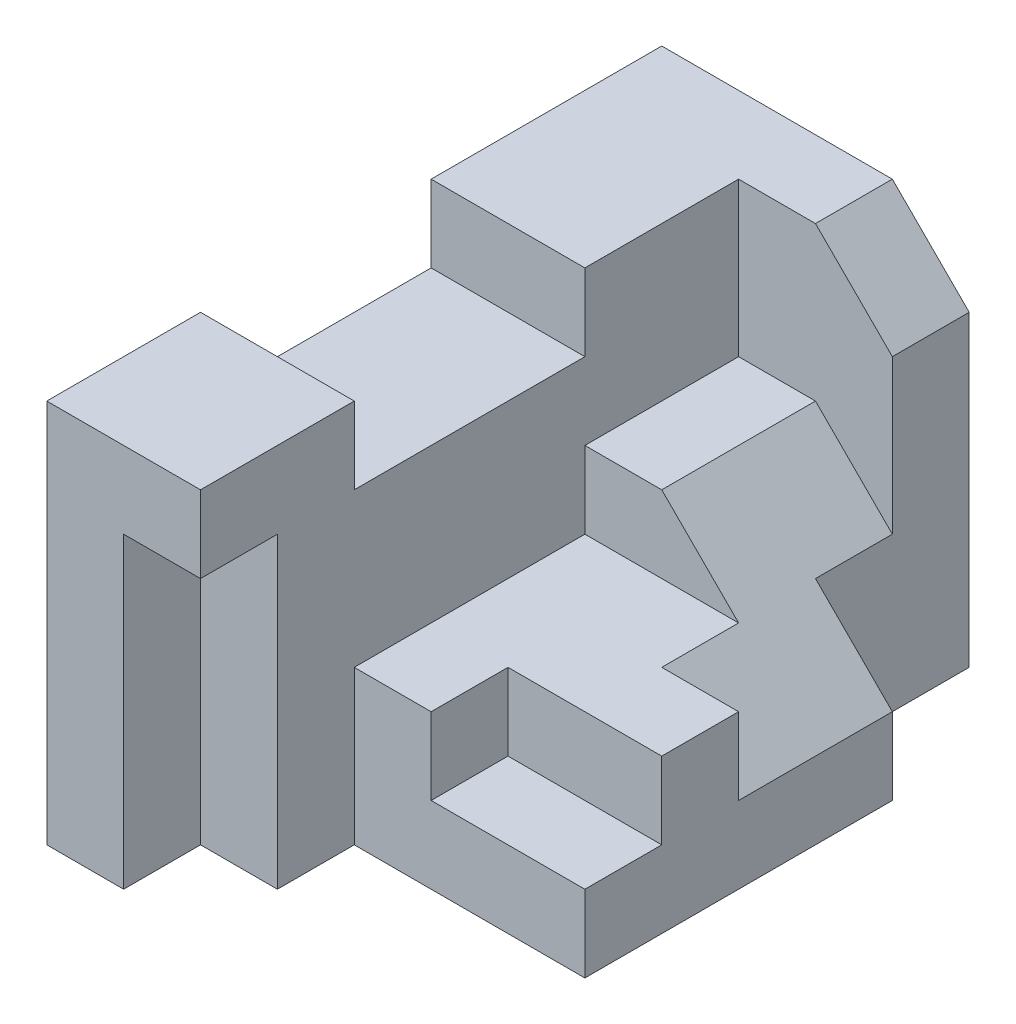
ISO-10303-21;
HEADER;
FILE_DESCRIPTION(('STEP AP214'),'2;1');
FILE_NAME('part.step','',(''),(''),'','','');
FILE_SCHEMA(('AUTOMOTIVE_DESIGN { 1 0 10303 214 1 1 1 1 }'));
ENDSEC;
DATA;
#1=APPLICATION_CONTEXT('core data for automotive mechanical design processes');
#2=APPLICATION_PROTOCOL_DEFINITION('international standard','automotive_design',2000,#1);
#3=PRODUCT_CONTEXT('',#1,'mechanical');
#4=PRODUCT('Part','Part','',(#3));
#5=PRODUCT_RELATED_PRODUCT_CATEGORY('part','',(#4));
#6=PRODUCT_DEFINITION_FORMATION('','',#4);
#7=PRODUCT_DEFINITION_CONTEXT('part definition',#1,'design');
#8=PRODUCT_DEFINITION('design','',#6,#7);
#9=PRODUCT_DEFINITION_SHAPE('','',#8);
#10=(LENGTH_UNIT() NAMED_UNIT(*) SI_UNIT(.MILLI.,.METRE.));
#11=(NAMED_UNIT(*) PLANE_ANGLE_UNIT() SI_UNIT($,.RADIAN.));
#12=(NAMED_UNIT(*) SI_UNIT($,.STERADIAN.) SOLID_ANGLE_UNIT());
#13=UNCERTAINTY_MEASURE_WITH_UNIT(LENGTH_MEASURE(1.E-05),#10,'distance_accuracy_value','');
#14=(GEOMETRIC_REPRESENTATION_CONTEXT(3) GLOBAL_UNCERTAINTY_ASSIGNED_CONTEXT((#13)) GLOBAL_UNIT_ASSIGNED_CONTEXT((#10,
#11,#12)) REPRESENTATION_CONTEXT('',''));
#15=CARTESIAN_POINT('',(0.,0.,0.));
#16=DIRECTION('',(0.,0.,1.));
#17=DIRECTION('',(1.,0.,0.));
#18=AXIS2_PLACEMENT_3D('',#15,#16,#17);
#19=CARTESIAN_POINT('',(2.5,2.5,8.));
#20=DIRECTION('',(0.,-1.,0.));
#21=DIRECTION('',(1.,0.,0.));
#22=AXIS2_PLACEMENT_3D('',#19,#20,#21);
#23=PLANE('',#22);
#24=DIRECTION('',(-1.,0.,0.));
#25=VECTOR('',#24,1.);
#26=CARTESIAN_POINT('',(2.5,2.5,8.));
#27=LINE('',#26,#25);
#28=CARTESIAN_POINT('',(-0.5,2.5,8.));
#29=VERTEX_POINT('',#28);
#30=CARTESIAN_POINT('',(-2.5,2.5,8.));
#31=VERTEX_POINT('',#30);
#32=EDGE_CURVE('E317',#29,#31,#27,.T.);
#33=ORIENTED_EDGE('',*,*,#32,.F.);
#34=DIRECTION('',(0.,0.,1.));
#35=VECTOR('',#34,1.);
#36=CARTESIAN_POINT('',(-0.5,2.5,8.));
#37=LINE('',#36,#35);
#38=CARTESIAN_POINT('',(-0.5,2.5,6.));
#39=VERTEX_POINT('',#38);
#40=EDGE_CURVE('E398',#39,#29,#37,.T.);
#41=ORIENTED_EDGE('',*,*,#40,.F.);
#42=DIRECTION('',(1.,0.,0.));
#43=VECTOR('',#42,1.);
#44=CARTESIAN_POINT('',(-0.5,2.5,6.));
#45=LINE('',#44,#43);
#46=CARTESIAN_POINT('',(-2.5,2.5,6.));
#47=VERTEX_POINT('',#46);
#48=EDGE_CURVE('E277',#47,#39,#45,.T.);
#49=ORIENTED_EDGE('',*,*,#48,.F.);
#50=DIRECTION('',(0.,0.,-1.));
#51=VECTOR('',#50,1.);
#52=CARTESIAN_POINT('',(-2.5,2.5,8.));
#53=LINE('',#52,#51);
#54=EDGE_CURVE('E326',#31,#47,#53,.T.);
#55=ORIENTED_EDGE('',*,*,#54,.F.);
#56=EDGE_LOOP('',(#33,#41,#49,#55));
#57=FACE_BOUND('',#56,.T.);
#58=ADVANCED_FACE('F33',(#57),#23,.F.);
#59=CARTESIAN_POINT('',(-2.5,-2.5,8.));
#60=DIRECTION('',(1.,0.,0.));
#61=DIRECTION('',(0.,0.,-1.));
#62=AXIS2_PLACEMENT_3D('',#59,#60,#61);
#63=PLANE('',#62);
#64=DIRECTION('',(0.,0.,1.));
#65=VECTOR('',#64,1.);
#66=CARTESIAN_POINT('',(-2.5,1.5,6.));
#67=LINE('',#66,#65);
#68=CARTESIAN_POINT('',(-2.5,1.5,3.));
#69=VERTEX_POINT('',#68);
#70=CARTESIAN_POINT('',(-2.5,1.5,6.));
#71=VERTEX_POINT('',#70);
#72=EDGE_CURVE('E283',#69,#71,#67,.T.);
#73=ORIENTED_EDGE('',*,*,#72,.F.);
#74=DIRECTION('',(0.,1.,0.));
#75=VECTOR('',#74,1.);
#76=CARTESIAN_POINT('',(-2.5,1.5,3.));
#77=LINE('',#76,#75);
#78=CARTESIAN_POINT('',(-2.5,2.5,3.));
#79=VERTEX_POINT('',#78);
#80=EDGE_CURVE('E300',#69,#79,#77,.T.);
#81=ORIENTED_EDGE('',*,*,#80,.T.);
#82=CARTESIAN_POINT('',(-2.5,2.5,0.));
#83=VERTEX_POINT('',#82);
#84=EDGE_CURVE('E319',#79,#83,#53,.T.);
#85=ORIENTED_EDGE('',*,*,#84,.T.);
#86=DIRECTION('',(0.,-1.,0.));
#87=VECTOR('',#86,1.);
#88=CARTESIAN_POINT('',(-2.5,-2.5,0.));
#89=LINE('',#88,#87);
#90=CARTESIAN_POINT('',(-2.5,-2.5,0.));
#91=VERTEX_POINT('',#90);
#92=EDGE_CURVE('E303',#83,#91,#89,.T.);
#93=ORIENTED_EDGE('',*,*,#92,.T.);
#94=DIRECTION('',(0.,0.,-1.));
#95=VECTOR('',#94,1.);
#96=CARTESIAN_POINT('',(-2.5,-2.5,8.));
#97=LINE('',#96,#95);
#98=CARTESIAN_POINT('',(-2.5,-2.5,8.));
#99=VERTEX_POINT('',#98);
#100=EDGE_CURVE('E41',#99,#91,#97,.T.);
#101=ORIENTED_EDGE('',*,*,#100,.F.);
#102=DIRECTION('',(0.,-1.,0.));
#103=VECTOR('',#102,1.);
#104=CARTESIAN_POINT('',(-2.5,-2.5,8.));
#105=LINE('',#104,#103);
#106=EDGE_CURVE('E310',#31,#99,#105,.T.);
#107=ORIENTED_EDGE('',*,*,#106,.F.);
#108=ORIENTED_EDGE('',*,*,#54,.T.);
#109=DIRECTION('',(0.,1.,0.));
#110=VECTOR('',#109,1.);
#111=CARTESIAN_POINT('',(-2.5,1.5,6.));
#112=LINE('',#111,#110);
#113=EDGE_CURVE('E296',#71,#47,#112,.T.);
#114=ORIENTED_EDGE('',*,*,#113,.F.);
#115=EDGE_LOOP('',(#73,#81,#85,#93,#101,#107,#108,#114));
#116=FACE_BOUND('',#115,.T.);
#117=ADVANCED_FACE('F35',(#116),#63,.F.);
#118=CARTESIAN_POINT('',(2.5,-2.5,8.));
#119=DIRECTION('',(0.,1.,0.));
#120=DIRECTION('',(-1.,0.,0.));
#121=AXIS2_PLACEMENT_3D('',#118,#119,#120);
#122=PLANE('',#121);
#123=DIRECTION('',(1.,0.,0.));
#124=VECTOR('',#123,1.);
#125=CARTESIAN_POINT('',(2.5,-2.5,0.));
#126=LINE('',#125,#124);
#127=CARTESIAN_POINT('',(1.5,-2.5,0.));
#128=VERTEX_POINT('',#127);
#129=EDGE_CURVE('E322',#91,#128,#126,.T.);
#130=ORIENTED_EDGE('',*,*,#129,.T.);
#131=DIRECTION('',(0.,0.,-1.));
#132=VECTOR('',#131,1.);
#133=CARTESIAN_POINT('',(1.5,-2.5,2.));
#134=LINE('',#133,#132);
#135=CARTESIAN_POINT('',(1.5,-2.5,2.));
#136=VERTEX_POINT('',#135);
#137=EDGE_CURVE('E370',#136,#128,#134,.T.);
#138=ORIENTED_EDGE('',*,*,#137,.F.);
#139=DIRECTION('',(-1.,0.,0.));
#140=VECTOR('',#139,1.);
#141=CARTESIAN_POINT('',(1.5,-2.5,2.));
#142=LINE('',#141,#140);
#143=CARTESIAN_POINT('',(2.5,-2.5,2.));
#144=VERTEX_POINT('',#143);
#145=EDGE_CURVE('E703',#144,#136,#142,.T.);
#146=ORIENTED_EDGE('',*,*,#145,.F.);
#147=DIRECTION('',(0.,0.,-1.));
#148=VECTOR('',#147,1.);
#149=CARTESIAN_POINT('',(2.5,-2.5,8.));
#150=LINE('',#149,#148);
#151=CARTESIAN_POINT('',(2.5,-2.5,6.));
#152=VERTEX_POINT('',#151);
#153=EDGE_CURVE('E329',#152,#144,#150,.T.);
#154=ORIENTED_EDGE('',*,*,#153,.F.);
#155=DIRECTION('',(1.,0.,0.));
#156=VECTOR('',#155,1.);
#157=CARTESIAN_POINT('',(-0.5,-2.5,6.));
#158=LINE('',#157,#156);
#159=CARTESIAN_POINT('',(-0.5,-2.5,6.));
#160=VERTEX_POINT('',#159);
#161=EDGE_CURVE('E258',#160,#152,#158,.T.);
#162=ORIENTED_EDGE('',*,*,#161,.F.);
#163=DIRECTION('',(0.,0.,-1.));
#164=VECTOR('',#163,1.);
#165=CARTESIAN_POINT('',(-0.5,-2.5,6.));
#166=LINE('',#165,#164);
#167=CARTESIAN_POINT('',(-0.5,-2.5,7.));
#168=VERTEX_POINT('',#167);
#169=EDGE_CURVE('E250',#168,#160,#166,.T.);
#170=ORIENTED_EDGE('',*,*,#169,.F.);
#171=DIRECTION('',(1.,0.,0.));
#172=VECTOR('',#171,1.);
#173=CARTESIAN_POINT('',(-1.5,-2.5,7.));
#174=LINE('',#173,#172);
#175=CARTESIAN_POINT('',(-1.5,-2.5,7.));
#176=VERTEX_POINT('',#175);
#177=EDGE_CURVE('E273',#176,#168,#174,.T.);
#178=ORIENTED_EDGE('',*,*,#177,.F.);
#179=DIRECTION('',(0.,0.,-1.));
#180=VECTOR('',#179,1.);
#181=CARTESIAN_POINT('',(-1.5,-2.5,7.));
#182=LINE('',#181,#180);
#183=CARTESIAN_POINT('',(-1.5,-2.5,8.));
#184=VERTEX_POINT('',#183);
#185=EDGE_CURVE('E267',#184,#176,#182,.T.);
#186=ORIENTED_EDGE('',*,*,#185,.F.);
#187=DIRECTION('',(1.,0.,0.));
#188=VECTOR('',#187,1.);
#189=CARTESIAN_POINT('',(2.5,-2.5,8.));
#190=LINE('',#189,#188);
#191=EDGE_CURVE('E313',#99,#184,#190,.T.);
#192=ORIENTED_EDGE('',*,*,#191,.F.);
#193=ORIENTED_EDGE('',*,*,#100,.T.);
#194=EDGE_LOOP('',(#130,#138,#146,#154,#162,#170,#178,#186,#192,#193));
#195=FACE_BOUND('',#194,.T.);
#196=ADVANCED_FACE('F334',(#195),#122,.F.);
#197=CARTESIAN_POINT('',(2.5,-2.5,8.));
#198=DIRECTION('',(-1.,0.,0.));
#199=DIRECTION('',(0.,0.,1.));
#200=AXIS2_PLACEMENT_3D('',#197,#198,#199);
#201=PLANE('',#200);
#202=DIRECTION('',(0.,-1.,0.));
#203=VECTOR('',#202,1.);
#204=CARTESIAN_POINT('',(2.5,-2.5,2.));
#205=LINE('',#204,#203);
#206=CARTESIAN_POINT('',(2.5,-1.5,2.));
#207=VERTEX_POINT('',#206);
#208=EDGE_CURVE('E355',#207,#144,#205,.T.);
#209=ORIENTED_EDGE('',*,*,#208,.F.);
#210=DIRECTION('',(0.,0.,-1.));
#211=VECTOR('',#210,1.);
#212=CARTESIAN_POINT('',(2.5,-1.5,4.));
#213=LINE('',#212,#211);
#214=CARTESIAN_POINT('',(2.5,-1.5,4.));
#215=VERTEX_POINT('',#214);
#216=EDGE_CURVE('E219',#215,#207,#213,.T.);
#217=ORIENTED_EDGE('',*,*,#216,.F.);
#218=DIRECTION('',(0.,-1.,0.));
#219=VECTOR('',#218,1.);
#220=CARTESIAN_POINT('',(2.5,-1.5,4.));
#221=LINE('',#220,#219);
#222=CARTESIAN_POINT('',(2.5,-0.5,4.));
#223=VERTEX_POINT('',#222);
#224=EDGE_CURVE('E206',#223,#215,#221,.T.);
#225=ORIENTED_EDGE('',*,*,#224,.F.);
#226=DIRECTION('',(0.,0.,-1.));
#227=VECTOR('',#226,1.);
#228=CARTESIAN_POINT('',(2.5,-0.5,3.));
#229=LINE('',#228,#227);
#230=CARTESIAN_POINT('',(2.5,-0.5,5.));
#231=VERTEX_POINT('',#230);
#232=EDGE_CURVE('E218',#231,#223,#229,.T.);
#233=ORIENTED_EDGE('',*,*,#232,.F.);
#234=DIRECTION('',(0.,1.,0.));
#235=VECTOR('',#234,1.);
#236=CARTESIAN_POINT('',(2.5,-1.5,5.));
#237=LINE('',#236,#235);
#238=CARTESIAN_POINT('',(2.5,-1.5,5.));
#239=VERTEX_POINT('',#238);
#240=EDGE_CURVE('E48',#239,#231,#237,.T.);
#241=ORIENTED_EDGE('',*,*,#240,.F.);
#242=DIRECTION('',(0.,0.,1.));
#243=VECTOR('',#242,1.);
#244=CARTESIAN_POINT('',(2.5,-1.5,5.));
#245=LINE('',#244,#243);
#246=CARTESIAN_POINT('',(2.5,-1.5,6.));
#247=VERTEX_POINT('',#246);
#248=EDGE_CURVE('E225',#239,#247,#245,.T.);
#249=ORIENTED_EDGE('',*,*,#248,.T.);
#250=DIRECTION('',(0.,1.,0.));
#251=VECTOR('',#250,1.);
#252=CARTESIAN_POINT('',(2.5,-0.5,6.));
#253=LINE('',#252,#251);
#254=EDGE_CURVE('E240',#152,#247,#253,.T.);
#255=ORIENTED_EDGE('',*,*,#254,.F.);
#256=ORIENTED_EDGE('',*,*,#153,.T.);
#257=EDGE_LOOP('',(#209,#217,#225,#233,#241,#249,#255,#256));
#258=FACE_BOUND('',#257,.T.);
#259=ADVANCED_FACE('F217',(#258),#201,.F.);
#260=DIRECTION('',(1.,0.,0.));
#261=VECTOR('',#260,1.);
#262=CARTESIAN_POINT('',(-0.5,2.5,1.));
#263=LINE('',#262,#261);
#264=CARTESIAN_POINT('',(-0.5,2.5,1.));
#265=VERTEX_POINT('',#264);
#266=CARTESIAN_POINT('',(0.5,2.5,1.));
#267=VERTEX_POINT('',#266);
#268=EDGE_CURVE('E237',#265,#267,#263,.T.);
#269=ORIENTED_EDGE('',*,*,#268,.T.);
#270=DIRECTION('',(0.,0.,-1.));
#271=VECTOR('',#270,1.);
#272=CARTESIAN_POINT('',(0.5,2.5,2.));
#273=LINE('',#272,#271);
#274=CARTESIAN_POINT('',(0.5,2.5,0.));
#275=VERTEX_POINT('',#274);
#276=EDGE_CURVE('E364',#267,#275,#273,.T.);
#277=ORIENTED_EDGE('',*,*,#276,.T.);
#278=DIRECTION('',(-1.,0.,0.));
#279=VECTOR('',#278,1.);
#280=CARTESIAN_POINT('',(2.5,2.5,0.));
#281=LINE('',#280,#279);
#282=EDGE_CURVE('E314',#275,#83,#281,.T.);
#283=ORIENTED_EDGE('',*,*,#282,.T.);
#284=ORIENTED_EDGE('',*,*,#84,.F.);
#285=DIRECTION('',(-1.,0.,0.));
#286=VECTOR('',#285,1.);
#287=CARTESIAN_POINT('',(-2.5,2.5,3.));
#288=LINE('',#287,#286);
#289=CARTESIAN_POINT('',(-0.5,2.5,3.));
#290=VERTEX_POINT('',#289);
#291=EDGE_CURVE('E287',#290,#79,#288,.T.);
#292=ORIENTED_EDGE('',*,*,#291,.F.);
#293=EDGE_CURVE('E399',#265,#290,#37,.T.);
#294=ORIENTED_EDGE('',*,*,#293,.F.);
#295=EDGE_LOOP('',(#269,#277,#283,#284,#292,#294));
#296=FACE_BOUND('',#295,.T.);
#297=ADVANCED_FACE('F454',(#296),#23,.F.);
#298=CARTESIAN_POINT('',(0.,0.,8.));
#299=DIRECTION('',(0.,0.,1.));
#300=DIRECTION('',(1.,0.,0.));
#301=AXIS2_PLACEMENT_3D('',#298,#299,#300);
#302=PLANE('',#301);
#303=DIRECTION('',(0.,-1.,0.));
#304=VECTOR('',#303,1.);
#305=CARTESIAN_POINT('',(-0.5,1.5,8.));
#306=LINE('',#305,#304);
#307=CARTESIAN_POINT('',(-0.5,1.5,8.));
#308=VERTEX_POINT('',#307);
#309=EDGE_CURVE('E235',#29,#308,#306,.T.);
#310=ORIENTED_EDGE('',*,*,#309,.F.);
#311=ORIENTED_EDGE('',*,*,#32,.T.);
#312=ORIENTED_EDGE('',*,*,#106,.T.);
#313=ORIENTED_EDGE('',*,*,#191,.T.);
#314=DIRECTION('',(0.,-1.,0.));
#315=VECTOR('',#314,1.);
#316=CARTESIAN_POINT('',(-1.5,-2.5,8.));
#317=LINE('',#316,#315);
#318=CARTESIAN_POINT('',(-1.5,1.5,8.));
#319=VERTEX_POINT('',#318);
#320=EDGE_CURVE('E264',#319,#184,#317,.T.);
#321=ORIENTED_EDGE('',*,*,#320,.F.);
#322=DIRECTION('',(1.,0.,0.));
#323=VECTOR('',#322,1.);
#324=CARTESIAN_POINT('',(-1.5,1.5,8.));
#325=LINE('',#324,#323);
#326=EDGE_CURVE('E274',#319,#308,#325,.T.);
#327=ORIENTED_EDGE('',*,*,#326,.T.);
#328=EDGE_LOOP('',(#310,#311,#312,#313,#321,#327));
#329=FACE_BOUND('',#328,.T.);
#330=ADVANCED_FACE('F411',(#329),#302,.T.);
#331=CARTESIAN_POINT('',(0.,0.,0.));
#332=DIRECTION('',(0.,0.,1.));
#333=DIRECTION('',(1.,0.,0.));
#334=AXIS2_PLACEMENT_3D('',#331,#332,#333);
#335=PLANE('',#334);
#336=ORIENTED_EDGE('',*,*,#282,.F.);
#337=DIRECTION('',(-0.707106781186547,0.707106781186548,0.));
#338=VECTOR('',#337,1.);
#339=CARTESIAN_POINT('',(0.5,2.5,0.));
#340=LINE('',#339,#338);
#341=CARTESIAN_POINT('',(1.5,1.5,0.));
#342=VERTEX_POINT('',#341);
#343=EDGE_CURVE('E350',#342,#275,#340,.T.);
#344=ORIENTED_EDGE('',*,*,#343,.F.);
#345=DIRECTION('',(0.,1.,0.));
#346=VECTOR('',#345,1.);
#347=CARTESIAN_POINT('',(1.5,1.5,0.));
#348=LINE('',#347,#346);
#349=EDGE_CURVE('E349',#128,#342,#348,.T.);
#350=ORIENTED_EDGE('',*,*,#349,.F.);
#351=ORIENTED_EDGE('',*,*,#129,.F.);
#352=ORIENTED_EDGE('',*,*,#92,.F.);
#353=EDGE_LOOP('',(#336,#344,#350,#351,#352));
#354=FACE_BOUND('',#353,.T.);
#355=ADVANCED_FACE('F345',(#354),#335,.F.);
#356=CARTESIAN_POINT('',(-2.5,1.5,3.));
#357=DIRECTION('',(0.,0.,-1.));
#358=DIRECTION('',(-1.,0.,0.));
#359=AXIS2_PLACEMENT_3D('',#356,#357,#358);
#360=PLANE('',#359);
#361=ORIENTED_EDGE('',*,*,#291,.T.);
#362=ORIENTED_EDGE('',*,*,#80,.F.);
#363=DIRECTION('',(-1.,0.,0.));
#364=VECTOR('',#363,1.);
#365=CARTESIAN_POINT('',(-2.5,1.5,3.));
#366=LINE('',#365,#364);
#367=CARTESIAN_POINT('',(-0.5,1.5,3.));
#368=VERTEX_POINT('',#367);
#369=EDGE_CURVE('E293',#368,#69,#366,.T.);
#370=ORIENTED_EDGE('',*,*,#369,.F.);
#371=DIRECTION('',(0.,1.,0.));
#372=VECTOR('',#371,1.);
#373=CARTESIAN_POINT('',(-0.500000000000001,1.5,3.));
#374=LINE('',#373,#372);
#375=EDGE_CURVE('E304',#368,#290,#374,.T.);
#376=ORIENTED_EDGE('',*,*,#375,.T.);
#377=EDGE_LOOP('',(#361,#362,#370,#376));
#378=FACE_BOUND('',#377,.T.);
#379=ADVANCED_FACE('F456',(#378),#360,.F.);
#380=CARTESIAN_POINT('',(-0.5,1.5,6.));
#381=DIRECTION('',(0.,0.,1.));
#382=DIRECTION('',(1.,0.,0.));
#383=AXIS2_PLACEMENT_3D('',#380,#381,#382);
#384=PLANE('',#383);
#385=ORIENTED_EDGE('',*,*,#48,.T.);
#386=DIRECTION('',(0.,1.,0.));
#387=VECTOR('',#386,1.);
#388=CARTESIAN_POINT('',(-0.5,1.5,6.));
#389=LINE('',#388,#387);
#390=CARTESIAN_POINT('',(-0.5,1.5,6.));
#391=VERTEX_POINT('',#390);
#392=EDGE_CURVE('E307',#391,#39,#389,.T.);
#393=ORIENTED_EDGE('',*,*,#392,.F.);
#394=DIRECTION('',(1.,0.,0.));
#395=VECTOR('',#394,1.);
#396=CARTESIAN_POINT('',(-0.5,1.5,6.));
#397=LINE('',#396,#395);
#398=EDGE_CURVE('E286',#71,#391,#397,.T.);
#399=ORIENTED_EDGE('',*,*,#398,.F.);
#400=ORIENTED_EDGE('',*,*,#113,.T.);
#401=EDGE_LOOP('',(#385,#393,#399,#400));
#402=FACE_BOUND('',#401,.T.);
#403=ADVANCED_FACE('F461',(#402),#384,.F.);
#404=CARTESIAN_POINT('',(0.,1.5,0.));
#405=DIRECTION('',(0.,-1.,0.));
#406=DIRECTION('',(1.,0.,0.));
#407=AXIS2_PLACEMENT_3D('',#404,#405,#406);
#408=PLANE('',#407);
#409=ORIENTED_EDGE('',*,*,#72,.T.);
#410=ORIENTED_EDGE('',*,*,#398,.T.);
#411=DIRECTION('',(0.,0.,-1.));
#412=VECTOR('',#411,1.);
#413=CARTESIAN_POINT('',(-0.500000000000001,1.5,3.));
#414=LINE('',#413,#412);
#415=EDGE_CURVE('E290',#391,#368,#414,.T.);
#416=ORIENTED_EDGE('',*,*,#415,.T.);
#417=ORIENTED_EDGE('',*,*,#369,.T.);
#418=EDGE_LOOP('',(#409,#410,#416,#417));
#419=FACE_BOUND('',#418,.T.);
#420=ADVANCED_FACE('F459',(#419),#408,.F.);
#421=CARTESIAN_POINT('',(-1.5,1.5,8.));
#422=DIRECTION('',(0.,1.,0.));
#423=DIRECTION('',(0.,0.,1.));
#424=AXIS2_PLACEMENT_3D('',#421,#422,#423);
#425=PLANE('',#424);
#426=DIRECTION('',(1.,0.,0.));
#427=VECTOR('',#426,1.);
#428=CARTESIAN_POINT('',(-1.5,1.5,7.));
#429=LINE('',#428,#427);
#430=CARTESIAN_POINT('',(-1.5,1.5,7.));
#431=VERTEX_POINT('',#430);
#432=CARTESIAN_POINT('',(-0.5,1.5,7.));
#433=VERTEX_POINT('',#432);
#434=EDGE_CURVE('E278',#431,#433,#429,.T.);
#435=ORIENTED_EDGE('',*,*,#434,.T.);
#436=DIRECTION('',(0.,0.,-1.));
#437=VECTOR('',#436,1.);
#438=CARTESIAN_POINT('',(-0.5,1.5,7.));
#439=LINE('',#438,#437);
#440=EDGE_CURVE('E224',#308,#433,#439,.T.);
#441=ORIENTED_EDGE('',*,*,#440,.F.);
#442=ORIENTED_EDGE('',*,*,#326,.F.);
#443=DIRECTION('',(0.,0.,1.));
#444=VECTOR('',#443,1.);
#445=CARTESIAN_POINT('',(-1.5,1.5,8.));
#446=LINE('',#445,#444);
#447=EDGE_CURVE('E56',#431,#319,#446,.T.);
#448=ORIENTED_EDGE('',*,*,#447,.F.);
#449=EDGE_LOOP('',(#435,#441,#442,#448));
#450=FACE_BOUND('',#449,.T.);
#451=ADVANCED_FACE('F422',(#450),#425,.F.);
#452=CARTESIAN_POINT('',(-1.5,1.5,7.));
#453=DIRECTION('',(0.,0.,-1.));
#454=DIRECTION('',(-1.,0.,0.));
#455=AXIS2_PLACEMENT_3D('',#452,#453,#454);
#456=PLANE('',#455);
#457=DIRECTION('',(0.,-1.,0.));
#458=VECTOR('',#457,1.);
#459=CARTESIAN_POINT('',(-0.5,-2.5,7.));
#460=LINE('',#459,#458);
#461=EDGE_CURVE('E256',#433,#168,#460,.T.);
#462=ORIENTED_EDGE('',*,*,#461,.F.);
#463=ORIENTED_EDGE('',*,*,#434,.F.);
#464=DIRECTION('',(0.,1.,0.));
#465=VECTOR('',#464,1.);
#466=CARTESIAN_POINT('',(-1.5,1.5,7.));
#467=LINE('',#466,#465);
#468=EDGE_CURVE('E270',#176,#431,#467,.T.);
#469=ORIENTED_EDGE('',*,*,#468,.F.);
#470=ORIENTED_EDGE('',*,*,#177,.T.);
#471=EDGE_LOOP('',(#462,#463,#469,#470));
#472=FACE_BOUND('',#471,.T.);
#473=ADVANCED_FACE('F420',(#472),#456,.F.);
#474=CARTESIAN_POINT('',(-1.5,0.,0.));
#475=DIRECTION('',(-1.,0.,0.));
#476=DIRECTION('',(0.,0.,1.));
#477=AXIS2_PLACEMENT_3D('',#474,#475,#476);
#478=PLANE('',#477);
#479=ORIENTED_EDGE('',*,*,#320,.T.);
#480=ORIENTED_EDGE('',*,*,#185,.T.);
#481=ORIENTED_EDGE('',*,*,#468,.T.);
#482=ORIENTED_EDGE('',*,*,#447,.T.);
#483=EDGE_LOOP('',(#479,#480,#481,#482));
#484=FACE_BOUND('',#483,.T.);
#485=ADVANCED_FACE('F415',(#484),#478,.F.);
#486=CARTESIAN_POINT('',(-0.5,-0.5,6.));
#487=DIRECTION('',(0.,0.,-1.));
#488=DIRECTION('',(-1.,0.,0.));
#489=AXIS2_PLACEMENT_3D('',#486,#487,#488);
#490=PLANE('',#489);
#491=ORIENTED_EDGE('',*,*,#254,.T.);
#492=DIRECTION('',(1.,0.,0.));
#493=VECTOR('',#492,1.);
#494=CARTESIAN_POINT('',(0.5,-1.5,6.));
#495=LINE('',#494,#493);
#496=CARTESIAN_POINT('',(0.5,-1.5,6.));
#497=VERTEX_POINT('',#496);
#498=EDGE_CURVE('E377',#497,#247,#495,.T.);
#499=ORIENTED_EDGE('',*,*,#498,.F.);
#500=DIRECTION('',(0.,-1.,0.));
#501=VECTOR('',#500,1.);
#502=CARTESIAN_POINT('',(0.5,-0.5,6.));
#503=LINE('',#502,#501);
#504=CARTESIAN_POINT('',(0.5,-0.5,6.));
#505=VERTEX_POINT('',#504);
#506=EDGE_CURVE('E374',#505,#497,#503,.T.);
#507=ORIENTED_EDGE('',*,*,#506,.F.);
#508=DIRECTION('',(1.,0.,0.));
#509=VECTOR('',#508,1.);
#510=CARTESIAN_POINT('',(-0.5,-0.5,6.));
#511=LINE('',#510,#509);
#512=CARTESIAN_POINT('',(-0.5,-0.5,6.));
#513=VERTEX_POINT('',#512);
#514=EDGE_CURVE('E261',#513,#505,#511,.T.);
#515=ORIENTED_EDGE('',*,*,#514,.F.);
#516=DIRECTION('',(0.,1.,0.));
#517=VECTOR('',#516,1.);
#518=CARTESIAN_POINT('',(-0.5,-0.5,6.));
#519=LINE('',#518,#517);
#520=EDGE_CURVE('E253',#160,#513,#519,.T.);
#521=ORIENTED_EDGE('',*,*,#520,.F.);
#522=ORIENTED_EDGE('',*,*,#161,.T.);
#523=EDGE_LOOP('',(#491,#499,#507,#515,#521,#522));
#524=FACE_BOUND('',#523,.T.);
#525=ADVANCED_FACE('F427',(#524),#490,.F.);
#526=CARTESIAN_POINT('',(-0.5,0.,0.));
#527=DIRECTION('',(-1.,0.,0.));
#528=DIRECTION('',(0.,0.,1.));
#529=AXIS2_PLACEMENT_3D('',#526,#527,#528);
#530=PLANE('',#529);
#531=ORIENTED_EDGE('',*,*,#169,.T.);
#532=ORIENTED_EDGE('',*,*,#520,.T.);
#533=DIRECTION('',(0.,0.,-1.));
#534=VECTOR('',#533,1.);
#535=CARTESIAN_POINT('',(-0.5,-0.5,6.));
#536=LINE('',#535,#534);
#537=CARTESIAN_POINT('',(-0.5,-0.5,3.));
#538=VERTEX_POINT('',#537);
#539=EDGE_CURVE('E228',#513,#538,#536,.T.);
#540=ORIENTED_EDGE('',*,*,#539,.T.);
#541=DIRECTION('',(0.,1.,0.));
#542=VECTOR('',#541,1.);
#543=CARTESIAN_POINT('',(-0.5,0.5,3.));
#544=LINE('',#543,#542);
#545=CARTESIAN_POINT('',(-0.5,0.5,3.));
#546=VERTEX_POINT('',#545);
#547=EDGE_CURVE('E390',#538,#546,#544,.T.);
#548=ORIENTED_EDGE('',*,*,#547,.T.);
#549=DIRECTION('',(0.,0.,-1.));
#550=VECTOR('',#549,1.);
#551=CARTESIAN_POINT('',(-0.5,0.5,1.));
#552=LINE('',#551,#550);
#553=CARTESIAN_POINT('',(-0.5,0.5,1.));
#554=VERTEX_POINT('',#553);
#555=EDGE_CURVE('E393',#546,#554,#552,.T.);
#556=ORIENTED_EDGE('',*,*,#555,.T.);
#557=DIRECTION('',(0.,1.,0.));
#558=VECTOR('',#557,1.);
#559=CARTESIAN_POINT('',(-0.5,2.5,1.));
#560=LINE('',#559,#558);
#561=EDGE_CURVE('E396',#554,#265,#560,.T.);
#562=ORIENTED_EDGE('',*,*,#561,.T.);
#563=ORIENTED_EDGE('',*,*,#293,.T.);
#564=ORIENTED_EDGE('',*,*,#375,.F.);
#565=ORIENTED_EDGE('',*,*,#415,.F.);
#566=ORIENTED_EDGE('',*,*,#392,.T.);
#567=ORIENTED_EDGE('',*,*,#40,.T.);
#568=ORIENTED_EDGE('',*,*,#309,.T.);
#569=ORIENTED_EDGE('',*,*,#440,.T.);
#570=ORIENTED_EDGE('',*,*,#461,.T.);
#571=EDGE_LOOP('',(#531,#532,#540,#548,#556,#562,#563,#564,#565,#566,#567,#568,#569,#570));
#572=FACE_BOUND('',#571,.T.);
#573=ADVANCED_FACE('F404',(#572),#530,.F.);
#574=CARTESIAN_POINT('',(-0.5,-0.5,3.));
#575=DIRECTION('',(0.,-1.,0.));
#576=DIRECTION('',(0.,0.,-1.));
#577=AXIS2_PLACEMENT_3D('',#574,#575,#576);
#578=PLANE('',#577);
#579=DIRECTION('',(1.,0.,0.));
#580=VECTOR('',#579,1.);
#581=CARTESIAN_POINT('',(2.5,-0.5,4.));
#582=LINE('',#581,#580);
#583=CARTESIAN_POINT('',(1.5,-0.5,4.));
#584=VERTEX_POINT('',#583);
#585=EDGE_CURVE('E203',#584,#223,#582,.T.);
#586=ORIENTED_EDGE('',*,*,#585,.F.);
#587=DIRECTION('',(0.,0.,-1.));
#588=VECTOR('',#587,1.);
#589=CARTESIAN_POINT('',(1.5,-0.5,4.));
#590=LINE('',#589,#588);
#591=CARTESIAN_POINT('',(1.5,-0.5,3.));
#592=VERTEX_POINT('',#591);
#593=EDGE_CURVE('E695',#584,#592,#590,.T.);
#594=ORIENTED_EDGE('',*,*,#593,.T.);
#595=DIRECTION('',(1.,0.,0.));
#596=VECTOR('',#595,1.);
#597=CARTESIAN_POINT('',(-0.5,-0.5,3.));
#598=LINE('',#597,#596);
#599=EDGE_CURVE('E247',#538,#592,#598,.T.);
#600=ORIENTED_EDGE('',*,*,#599,.F.);
#601=ORIENTED_EDGE('',*,*,#539,.F.);
#602=ORIENTED_EDGE('',*,*,#514,.T.);
#603=DIRECTION('',(0.,0.,1.));
#604=VECTOR('',#603,1.);
#605=CARTESIAN_POINT('',(0.5,-0.5,5.));
#606=LINE('',#605,#604);
#607=CARTESIAN_POINT('',(0.5,-0.5,5.));
#608=VERTEX_POINT('',#607);
#609=EDGE_CURVE('E383',#608,#505,#606,.T.);
#610=ORIENTED_EDGE('',*,*,#609,.F.);
#611=DIRECTION('',(-1.,0.,0.));
#612=VECTOR('',#611,1.);
#613=CARTESIAN_POINT('',(2.5,-0.5,5.));
#614=LINE('',#613,#612);
#615=EDGE_CURVE('E223',#231,#608,#614,.T.);
#616=ORIENTED_EDGE('',*,*,#615,.F.);
#617=ORIENTED_EDGE('',*,*,#232,.T.);
#618=EDGE_LOOP('',(#586,#594,#600,#601,#602,#610,#616,#617));
#619=FACE_BOUND('',#618,.T.);
#620=ADVANCED_FACE('F221',(#619),#578,.F.);
#621=CARTESIAN_POINT('',(-0.5,2.5,1.));
#622=DIRECTION('',(0.,0.,-1.));
#623=DIRECTION('',(0.,1.,0.));
#624=AXIS2_PLACEMENT_3D('',#621,#622,#623);
#625=PLANE('',#624);
#626=DIRECTION('',(0.,1.,0.));
#627=VECTOR('',#626,1.);
#628=CARTESIAN_POINT('',(1.5,2.5,1.));
#629=LINE('',#628,#627);
#630=CARTESIAN_POINT('',(1.5,-0.5,1.));
#631=VERTEX_POINT('',#630);
#632=CARTESIAN_POINT('',(1.5,1.5,1.));
#633=VERTEX_POINT('',#632);
#634=EDGE_CURVE('E367',#631,#633,#629,.T.);
#635=ORIENTED_EDGE('',*,*,#634,.T.);
#636=DIRECTION('',(-0.707106781186547,0.707106781186548,0.));
#637=VECTOR('',#636,1.);
#638=CARTESIAN_POINT('',(0.,3.,1.));
#639=LINE('',#638,#637);
#640=EDGE_CURVE('E11',#633,#267,#639,.T.);
#641=ORIENTED_EDGE('',*,*,#640,.T.);
#642=ORIENTED_EDGE('',*,*,#268,.F.);
#643=ORIENTED_EDGE('',*,*,#561,.F.);
#644=DIRECTION('',(1.,0.,0.));
#645=VECTOR('',#644,1.);
#646=CARTESIAN_POINT('',(-0.5,0.5,1.));
#647=LINE('',#646,#645);
#648=CARTESIAN_POINT('',(0.5,0.5,1.));
#649=VERTEX_POINT('',#648);
#650=EDGE_CURVE('E241',#554,#649,#647,.T.);
#651=ORIENTED_EDGE('',*,*,#650,.T.);
#652=DIRECTION('',(0.707106781186548,-0.707106781186548,0.));
#653=VECTOR('',#652,1.);
#654=CARTESIAN_POINT('',(0.5,0.5,1.));
#655=LINE('',#654,#653);
#656=EDGE_CURVE('E696',#649,#631,#655,.T.);
#657=ORIENTED_EDGE('',*,*,#656,.T.);
#658=EDGE_LOOP('',(#635,#641,#642,#643,#651,#657));
#659=FACE_BOUND('',#658,.T.);
#660=ADVANCED_FACE('F451',(#659),#625,.F.);
#661=CARTESIAN_POINT('',(-0.5,0.5,1.));
#662=DIRECTION('',(0.,-1.,0.));
#663=DIRECTION('',(0.,0.,-1.));
#664=AXIS2_PLACEMENT_3D('',#661,#662,#663);
#665=PLANE('',#664);
#666=DIRECTION('',(1.,0.,0.));
#667=VECTOR('',#666,1.);
#668=CARTESIAN_POINT('',(-0.5,0.5,3.));
#669=LINE('',#668,#667);
#670=CARTESIAN_POINT('',(0.5,0.5,3.));
#671=VERTEX_POINT('',#670);
#672=EDGE_CURVE('E244',#546,#671,#669,.T.);
#673=ORIENTED_EDGE('',*,*,#672,.T.);
#674=DIRECTION('',(0.,0.,1.));
#675=VECTOR('',#674,1.);
#676=CARTESIAN_POINT('',(0.5,0.5,1.));
#677=LINE('',#676,#675);
#678=EDGE_CURVE('E358',#649,#671,#677,.T.);
#679=ORIENTED_EDGE('',*,*,#678,.F.);
#680=ORIENTED_EDGE('',*,*,#650,.F.);
#681=ORIENTED_EDGE('',*,*,#555,.F.);
#682=EDGE_LOOP('',(#673,#679,#680,#681));
#683=FACE_BOUND('',#682,.T.);
#684=ADVANCED_FACE('F447',(#683),#665,.F.);
#685=CARTESIAN_POINT('',(-0.5,0.5,3.));
#686=DIRECTION('',(0.,0.,-1.));
#687=DIRECTION('',(-1.,0.,0.));
#688=AXIS2_PLACEMENT_3D('',#685,#686,#687);
#689=PLANE('',#688);
#690=ORIENTED_EDGE('',*,*,#599,.T.);
#691=DIRECTION('',(0.707106781186548,-0.707106781186548,0.));
#692=VECTOR('',#691,1.);
#693=CARTESIAN_POINT('',(0.5,0.5,3.));
#694=LINE('',#693,#692);
#695=EDGE_CURVE('E444',#671,#592,#694,.T.);
#696=ORIENTED_EDGE('',*,*,#695,.F.);
#697=ORIENTED_EDGE('',*,*,#672,.F.);
#698=ORIENTED_EDGE('',*,*,#547,.F.);
#699=EDGE_LOOP('',(#690,#696,#697,#698));
#700=FACE_BOUND('',#699,.T.);
#701=ADVANCED_FACE('F441',(#700),#689,.F.);
#702=CARTESIAN_POINT('',(0.5,-1.5,5.));
#703=DIRECTION('',(0.,-1.,0.));
#704=DIRECTION('',(0.,0.,-1.));
#705=AXIS2_PLACEMENT_3D('',#702,#703,#704);
#706=PLANE('',#705);
#707=ORIENTED_EDGE('',*,*,#498,.T.);
#708=ORIENTED_EDGE('',*,*,#248,.F.);
#709=DIRECTION('',(1.,0.,0.));
#710=VECTOR('',#709,1.);
#711=CARTESIAN_POINT('',(0.5,-1.5,5.));
#712=LINE('',#711,#710);
#713=CARTESIAN_POINT('',(0.5,-1.5,5.));
#714=VERTEX_POINT('',#713);
#715=EDGE_CURVE('E380',#714,#239,#712,.T.);
#716=ORIENTED_EDGE('',*,*,#715,.F.);
#717=DIRECTION('',(0.,0.,1.));
#718=VECTOR('',#717,1.);
#719=CARTESIAN_POINT('',(0.5,-1.5,5.));
#720=LINE('',#719,#718);
#721=EDGE_CURVE('E231',#714,#497,#720,.T.);
#722=ORIENTED_EDGE('',*,*,#721,.T.);
#723=EDGE_LOOP('',(#707,#708,#716,#722));
#724=FACE_BOUND('',#723,.T.);
#725=ADVANCED_FACE('F432',(#724),#706,.F.);
#726=CARTESIAN_POINT('',(0.5,-0.5,5.));
#727=DIRECTION('',(-1.,0.,0.));
#728=DIRECTION('',(0.,-1.,0.));
#729=AXIS2_PLACEMENT_3D('',#726,#727,#728);
#730=PLANE('',#729);
#731=ORIENTED_EDGE('',*,*,#506,.T.);
#732=ORIENTED_EDGE('',*,*,#721,.F.);
#733=DIRECTION('',(0.,-1.,0.));
#734=VECTOR('',#733,1.);
#735=CARTESIAN_POINT('',(0.5,-0.5,5.));
#736=LINE('',#735,#734);
#737=EDGE_CURVE('E376',#608,#714,#736,.T.);
#738=ORIENTED_EDGE('',*,*,#737,.F.);
#739=ORIENTED_EDGE('',*,*,#609,.T.);
#740=EDGE_LOOP('',(#731,#732,#738,#739));
#741=FACE_BOUND('',#740,.T.);
#742=ADVANCED_FACE('F435',(#741),#730,.F.);
#743=CARTESIAN_POINT('',(0.,0.,5.));
#744=DIRECTION('',(0.,0.,1.));
#745=DIRECTION('',(1.,0.,0.));
#746=AXIS2_PLACEMENT_3D('',#743,#744,#745);
#747=PLANE('',#746);
#748=ORIENTED_EDGE('',*,*,#615,.T.);
#749=ORIENTED_EDGE('',*,*,#737,.T.);
#750=ORIENTED_EDGE('',*,*,#715,.T.);
#751=ORIENTED_EDGE('',*,*,#240,.T.);
#752=EDGE_LOOP('',(#748,#749,#750,#751));
#753=FACE_BOUND('',#752,.T.);
#754=ADVANCED_FACE('F433',(#753),#747,.T.);
#755=CARTESIAN_POINT('',(0.5,2.5,2.));
#756=DIRECTION('',(-0.707106781186548,-0.707106781186547,0.));
#757=DIRECTION('',(0.707106781186547,-0.707106781186548,0.));
#758=AXIS2_PLACEMENT_3D('',#755,#756,#757);
#759=PLANE('',#758);
#760=DIRECTION('',(0.,0.,-1.));
#761=VECTOR('',#760,1.);
#762=CARTESIAN_POINT('',(1.5,1.5,2.));
#763=LINE('',#762,#761);
#764=EDGE_CURVE('E368',#633,#342,#763,.T.);
#765=ORIENTED_EDGE('',*,*,#764,.T.);
#766=ORIENTED_EDGE('',*,*,#343,.T.);
#767=ORIENTED_EDGE('',*,*,#276,.F.);
#768=ORIENTED_EDGE('',*,*,#640,.F.);
#769=EDGE_LOOP('',(#765,#766,#767,#768));
#770=FACE_BOUND('',#769,.T.);
#771=ADVANCED_FACE('F590',(#770),#759,.F.);
#772=CARTESIAN_POINT('',(1.5,1.5,2.));
#773=DIRECTION('',(-1.,0.,0.));
#774=DIRECTION('',(0.,-1.,0.));
#775=AXIS2_PLACEMENT_3D('',#772,#773,#774);
#776=PLANE('',#775);
#777=ORIENTED_EDGE('',*,*,#634,.F.);
#778=DIRECTION('',(0.,0.,1.));
#779=VECTOR('',#778,1.);
#780=CARTESIAN_POINT('',(1.5,-0.5,1.));
#781=LINE('',#780,#779);
#782=CARTESIAN_POINT('',(1.5,-0.5,2.));
#783=VERTEX_POINT('',#782);
#784=EDGE_CURVE('E353',#631,#783,#781,.T.);
#785=ORIENTED_EDGE('',*,*,#784,.T.);
#786=DIRECTION('',(0.,1.,0.));
#787=VECTOR('',#786,1.);
#788=CARTESIAN_POINT('',(1.5,1.5,2.));
#789=LINE('',#788,#787);
#790=EDGE_CURVE('E361',#136,#783,#789,.T.);
#791=ORIENTED_EDGE('',*,*,#790,.F.);
#792=ORIENTED_EDGE('',*,*,#137,.T.);
#793=ORIENTED_EDGE('',*,*,#349,.T.);
#794=ORIENTED_EDGE('',*,*,#764,.F.);
#795=EDGE_LOOP('',(#777,#785,#791,#792,#793,#794));
#796=FACE_BOUND('',#795,.T.);
#797=ADVANCED_FACE('F600',(#796),#776,.F.);
#798=CARTESIAN_POINT('',(0.,0.,2.));
#799=DIRECTION('',(0.,0.,1.));
#800=DIRECTION('',(1.,0.,0.));
#801=AXIS2_PLACEMENT_3D('',#798,#799,#800);
#802=PLANE('',#801);
#803=ORIENTED_EDGE('',*,*,#790,.T.);
#804=DIRECTION('',(-0.707106781186548,0.707106781186547,0.));
#805=VECTOR('',#804,1.);
#806=CARTESIAN_POINT('',(1.5,-0.5,2.));
#807=LINE('',#806,#805);
#808=EDGE_CURVE('E211',#207,#783,#807,.T.);
#809=ORIENTED_EDGE('',*,*,#808,.F.);
#810=ORIENTED_EDGE('',*,*,#208,.T.);
#811=ORIENTED_EDGE('',*,*,#145,.T.);
#812=EDGE_LOOP('',(#803,#809,#810,#811));
#813=FACE_BOUND('',#812,.T.);
#814=ADVANCED_FACE('F609',(#813),#802,.F.);
#815=CARTESIAN_POINT('',(0.5,0.5,1.));
#816=DIRECTION('',(-0.707106781186547,-0.707106781186547,0.));
#817=DIRECTION('',(0.707106781186548,-0.707106781186548,0.));
#818=AXIS2_PLACEMENT_3D('',#815,#816,#817);
#819=PLANE('',#818);
#820=ORIENTED_EDGE('',*,*,#695,.T.);
#821=ORIENTED_EDGE('',*,*,#593,.F.);
#822=DIRECTION('',(-0.707106781186548,0.707106781186547,0.));
#823=VECTOR('',#822,1.);
#824=CARTESIAN_POINT('',(1.5,-0.5,4.));
#825=LINE('',#824,#823);
#826=EDGE_CURVE('E208',#215,#584,#825,.T.);
#827=ORIENTED_EDGE('',*,*,#826,.F.);
#828=ORIENTED_EDGE('',*,*,#216,.T.);
#829=ORIENTED_EDGE('',*,*,#808,.T.);
#830=ORIENTED_EDGE('',*,*,#784,.F.);
#831=ORIENTED_EDGE('',*,*,#656,.F.);
#832=ORIENTED_EDGE('',*,*,#678,.T.);
#833=EDGE_LOOP('',(#820,#821,#827,#828,#829,#830,#831,#832));
#834=FACE_BOUND('',#833,.T.);
#835=ADVANCED_FACE('F617',(#834),#819,.F.);
#836=CARTESIAN_POINT('',(0.,0.,4.));
#837=DIRECTION('',(0.,0.,-1.));
#838=DIRECTION('',(-1.,0.,0.));
#839=AXIS2_PLACEMENT_3D('',#836,#837,#838);
#840=PLANE('',#839);
#841=ORIENTED_EDGE('',*,*,#585,.T.);
#842=ORIENTED_EDGE('',*,*,#224,.T.);
#843=ORIENTED_EDGE('',*,*,#826,.T.);
#844=EDGE_LOOP('',(#841,#842,#843));
#845=FACE_BOUND('',#844,.T.);
#846=ADVANCED_FACE('F205',(#845),#840,.T.);
#847=CLOSED_SHELL('',(#58,#117,#196,#259,#297,#330,#355,#379,#403,#420,#451,#473,#485,#525,#573,
#620,#660,#684,#701,#725,#742,#754,#771,#797,#814,#835,#846));
#848=MANIFOLD_SOLID_BREP('B2',#847);
#849=ADVANCED_BREP_SHAPE_REPRESENTATION('',(#18,#848),#14);
#850=SHAPE_DEFINITION_REPRESENTATION(#9,#849);
ENDSEC;
END-ISO-10303-21;
